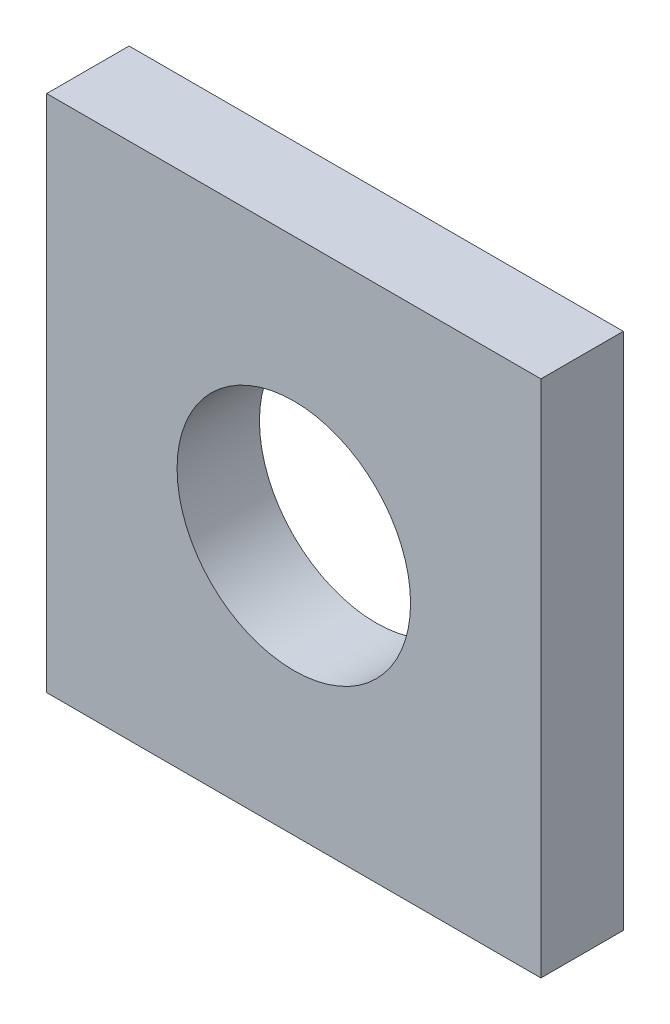
ISO-10303-21;
HEADER;
FILE_DESCRIPTION(('STEP AP214'),'2;1');
FILE_NAME('part.step','',(''),(''),'','','');
FILE_SCHEMA(('AUTOMOTIVE_DESIGN { 1 0 10303 214 1 1 1 1 }'));
ENDSEC;
DATA;
#1=APPLICATION_CONTEXT('core data for automotive mechanical design processes');
#2=APPLICATION_PROTOCOL_DEFINITION('international standard','automotive_design',2000,#1);
#3=PRODUCT_CONTEXT('',#1,'mechanical');
#4=PRODUCT('Part','Part','',(#3));
#5=PRODUCT_RELATED_PRODUCT_CATEGORY('part','',(#4));
#6=PRODUCT_DEFINITION_FORMATION('','',#4);
#7=PRODUCT_DEFINITION_CONTEXT('part definition',#1,'design');
#8=PRODUCT_DEFINITION('design','',#6,#7);
#9=PRODUCT_DEFINITION_SHAPE('','',#8);
#10=(LENGTH_UNIT() NAMED_UNIT(*) SI_UNIT(.MILLI.,.METRE.));
#11=(NAMED_UNIT(*) PLANE_ANGLE_UNIT() SI_UNIT($,.RADIAN.));
#12=(NAMED_UNIT(*) SI_UNIT($,.STERADIAN.) SOLID_ANGLE_UNIT());
#13=UNCERTAINTY_MEASURE_WITH_UNIT(LENGTH_MEASURE(1.E-05),#10,'distance_accuracy_value','');
#14=(GEOMETRIC_REPRESENTATION_CONTEXT(3) GLOBAL_UNCERTAINTY_ASSIGNED_CONTEXT((#13)) GLOBAL_UNIT_ASSIGNED_CONTEXT((#10,
#11,#12)) REPRESENTATION_CONTEXT('',''));
#15=CARTESIAN_POINT('',(0.,0.,0.));
#16=DIRECTION('',(0.,0.,1.));
#17=DIRECTION('',(1.,0.,0.));
#18=AXIS2_PLACEMENT_3D('',#15,#16,#17);
#19=CARTESIAN_POINT('',(-7.475,10.0000000000005,3.175));
#20=DIRECTION('',(0.,-1.,0.));
#21=DIRECTION('',(0.,0.,-1.));
#22=AXIS2_PLACEMENT_3D('',#19,#20,#21);
#23=PLANE('',#22);
#24=DIRECTION('',(-1.,0.,0.));
#25=VECTOR('',#24,1.);
#26=CARTESIAN_POINT('',(-7.475,10.0000000000005,0.));
#27=LINE('',#26,#25);
#28=CARTESIAN_POINT('',(-7.475,10.0000000000005,0.));
#29=VERTEX_POINT('',#28);
#30=CARTESIAN_POINT('',(-26.525,10.0000000000005,0.));
#31=VERTEX_POINT('',#30);
#32=EDGE_CURVE('E98',#29,#31,#27,.T.);
#33=ORIENTED_EDGE('',*,*,#32,.T.);
#34=DIRECTION('',(0.,0.,-1.));
#35=VECTOR('',#34,1.);
#36=CARTESIAN_POINT('',(-26.525,10.0000000000005,3.175));
#37=LINE('',#36,#35);
#38=CARTESIAN_POINT('',(-26.525,10.0000000000005,3.175));
#39=VERTEX_POINT('',#38);
#40=EDGE_CURVE('E11',#39,#31,#37,.T.);
#41=ORIENTED_EDGE('',*,*,#40,.F.);
#42=DIRECTION('',(-1.,0.,0.));
#43=VECTOR('',#42,1.);
#44=CARTESIAN_POINT('',(-7.475,10.0000000000005,3.175));
#45=LINE('',#44,#43);
#46=CARTESIAN_POINT('',(-7.475,10.0000000000005,3.175));
#47=VERTEX_POINT('',#46);
#48=EDGE_CURVE('E84',#47,#39,#45,.T.);
#49=ORIENTED_EDGE('',*,*,#48,.F.);
#50=DIRECTION('',(0.,0.,-1.));
#51=VECTOR('',#50,1.);
#52=CARTESIAN_POINT('',(-7.475,10.0000000000005,3.175));
#53=LINE('',#52,#51);
#54=EDGE_CURVE('E51',#47,#29,#53,.T.);
#55=ORIENTED_EDGE('',*,*,#54,.T.);
#56=EDGE_LOOP('',(#33,#41,#49,#55));
#57=FACE_BOUND('',#56,.T.);
#58=ADVANCED_FACE('F35',(#57),#23,.F.);
#59=CARTESIAN_POINT('',(-26.525,10.0000000000005,3.175));
#60=DIRECTION('',(1.,0.,0.));
#61=DIRECTION('',(0.,1.,0.));
#62=AXIS2_PLACEMENT_3D('',#59,#60,#61);
#63=PLANE('',#62);
#64=DIRECTION('',(0.,-1.,0.));
#65=VECTOR('',#64,1.);
#66=CARTESIAN_POINT('',(-26.525,10.0000000000005,0.));
#67=LINE('',#66,#65);
#68=CARTESIAN_POINT('',(-26.525,-10.0000000000004,0.));
#69=VERTEX_POINT('',#68);
#70=EDGE_CURVE('E89',#31,#69,#67,.T.);
#71=ORIENTED_EDGE('',*,*,#70,.T.);
#72=DIRECTION('',(0.,0.,-1.));
#73=VECTOR('',#72,1.);
#74=CARTESIAN_POINT('',(-26.525,-10.0000000000004,3.175));
#75=LINE('',#74,#73);
#76=CARTESIAN_POINT('',(-26.525,-10.0000000000004,3.175));
#77=VERTEX_POINT('',#76);
#78=EDGE_CURVE('E43',#77,#69,#75,.T.);
#79=ORIENTED_EDGE('',*,*,#78,.F.);
#80=DIRECTION('',(0.,-1.,0.));
#81=VECTOR('',#80,1.);
#82=CARTESIAN_POINT('',(-26.525,10.0000000000005,3.175));
#83=LINE('',#82,#81);
#84=EDGE_CURVE('E76',#39,#77,#83,.T.);
#85=ORIENTED_EDGE('',*,*,#84,.F.);
#86=ORIENTED_EDGE('',*,*,#40,.T.);
#87=EDGE_LOOP('',(#71,#79,#85,#86));
#88=FACE_BOUND('',#87,.T.);
#89=ADVANCED_FACE('F88',(#88),#63,.F.);
#90=CARTESIAN_POINT('',(-7.475,-10.0000000000004,3.175));
#91=DIRECTION('',(0.,-1.,0.));
#92=DIRECTION('',(0.,0.,-1.));
#93=AXIS2_PLACEMENT_3D('',#90,#91,#92);
#94=PLANE('',#93);
#95=DIRECTION('',(-1.,0.,0.));
#96=VECTOR('',#95,1.);
#97=CARTESIAN_POINT('',(-7.475,-10.0000000000004,0.));
#98=LINE('',#97,#96);
#99=CARTESIAN_POINT('',(-7.475,-10.0000000000004,0.));
#100=VERTEX_POINT('',#99);
#101=EDGE_CURVE('E102',#100,#69,#98,.T.);
#102=ORIENTED_EDGE('',*,*,#101,.F.);
#103=DIRECTION('',(0.,0.,-1.));
#104=VECTOR('',#103,1.);
#105=CARTESIAN_POINT('',(-7.475,-10.0000000000004,3.175));
#106=LINE('',#105,#104);
#107=CARTESIAN_POINT('',(-7.475,-10.0000000000004,3.175));
#108=VERTEX_POINT('',#107);
#109=EDGE_CURVE('E65',#108,#100,#106,.T.);
#110=ORIENTED_EDGE('',*,*,#109,.F.);
#111=DIRECTION('',(-1.,0.,0.));
#112=VECTOR('',#111,1.);
#113=CARTESIAN_POINT('',(-7.475,-10.0000000000004,3.175));
#114=LINE('',#113,#112);
#115=EDGE_CURVE('E83',#108,#77,#114,.T.);
#116=ORIENTED_EDGE('',*,*,#115,.T.);
#117=ORIENTED_EDGE('',*,*,#78,.T.);
#118=EDGE_LOOP('',(#102,#110,#116,#117));
#119=FACE_BOUND('',#118,.T.);
#120=ADVANCED_FACE('F92',(#119),#94,.T.);
#121=CARTESIAN_POINT('',(-7.475,10.0000000000005,3.175));
#122=DIRECTION('',(1.,0.,0.));
#123=DIRECTION('',(0.,1.,0.));
#124=AXIS2_PLACEMENT_3D('',#121,#122,#123);
#125=PLANE('',#124);
#126=DIRECTION('',(0.,-1.,0.));
#127=VECTOR('',#126,1.);
#128=CARTESIAN_POINT('',(-7.475,10.0000000000005,0.));
#129=LINE('',#128,#127);
#130=EDGE_CURVE('E104',#29,#100,#129,.T.);
#131=ORIENTED_EDGE('',*,*,#130,.F.);
#132=ORIENTED_EDGE('',*,*,#54,.F.);
#133=DIRECTION('',(0.,-1.,0.));
#134=VECTOR('',#133,1.);
#135=CARTESIAN_POINT('',(-7.475,10.0000000000005,3.175));
#136=LINE('',#135,#134);
#137=EDGE_CURVE('E93',#47,#108,#136,.T.);
#138=ORIENTED_EDGE('',*,*,#137,.T.);
#139=ORIENTED_EDGE('',*,*,#109,.T.);
#140=EDGE_LOOP('',(#131,#132,#138,#139));
#141=FACE_BOUND('',#140,.T.);
#142=ADVANCED_FACE('F120',(#141),#125,.T.);
#143=CARTESIAN_POINT('',(0.,0.,3.175));
#144=DIRECTION('',(0.,0.,1.));
#145=DIRECTION('',(1.,0.,0.));
#146=AXIS2_PLACEMENT_3D('',#143,#144,#145);
#147=PLANE('',#146);
#148=CARTESIAN_POINT('',(-17.,0.,3.175));
#149=DIRECTION('',(0.,0.,1.));
#150=DIRECTION('',(1.,0.,0.));
#151=AXIS2_PLACEMENT_3D('',#148,#149,#150);
#152=CIRCLE('',#151,4.5);
#153=CARTESIAN_POINT('',(-12.5,0.,3.175));
#154=VERTEX_POINT('',#153);
#155=EDGE_CURVE('E112',#154,#154,#152,.T.);
#156=ORIENTED_EDGE('',*,*,#155,.F.);
#157=EDGE_LOOP('',(#156));
#158=FACE_BOUND('',#157,.T.);
#159=ORIENTED_EDGE('',*,*,#48,.T.);
#160=ORIENTED_EDGE('',*,*,#84,.T.);
#161=ORIENTED_EDGE('',*,*,#115,.F.);
#162=ORIENTED_EDGE('',*,*,#137,.F.);
#163=EDGE_LOOP('',(#159,#160,#161,#162));
#164=FACE_BOUND('',#163,.T.);
#165=ADVANCED_FACE('F80',(#158,#164),#147,.T.);
#166=CARTESIAN_POINT('',(0.,0.,0.));
#167=DIRECTION('',(0.,0.,1.));
#168=DIRECTION('',(1.,0.,0.));
#169=AXIS2_PLACEMENT_3D('',#166,#167,#168);
#170=PLANE('',#169);
#171=CARTESIAN_POINT('',(-17.,0.,0.));
#172=DIRECTION('',(0.,0.,1.));
#173=DIRECTION('',(1.,0.,0.));
#174=AXIS2_PLACEMENT_3D('',#171,#172,#173);
#175=CIRCLE('',#174,4.5);
#176=CARTESIAN_POINT('',(-12.5,0.,0.));
#177=VERTEX_POINT('',#176);
#178=EDGE_CURVE('E100',#177,#177,#175,.T.);
#179=ORIENTED_EDGE('',*,*,#178,.T.);
#180=EDGE_LOOP('',(#179));
#181=FACE_BOUND('',#180,.T.);
#182=ORIENTED_EDGE('',*,*,#32,.F.);
#183=ORIENTED_EDGE('',*,*,#130,.T.);
#184=ORIENTED_EDGE('',*,*,#101,.T.);
#185=ORIENTED_EDGE('',*,*,#70,.F.);
#186=EDGE_LOOP('',(#182,#183,#184,#185));
#187=FACE_BOUND('',#186,.T.);
#188=ADVANCED_FACE('F119',(#181,#187),#170,.F.);
#189=CARTESIAN_POINT('',(-17.,0.,3.175));
#190=DIRECTION('',(0.,0.,1.));
#191=DIRECTION('',(1.,0.,0.));
#192=AXIS2_PLACEMENT_3D('',#189,#190,#191);
#193=CYLINDRICAL_SURFACE('',#192,4.5);
#194=ORIENTED_EDGE('',*,*,#178,.F.);
#195=EDGE_LOOP('',(#194));
#196=FACE_BOUND('',#195,.T.);
#197=ORIENTED_EDGE('',*,*,#155,.T.);
#198=EDGE_LOOP('',(#197));
#199=FACE_BOUND('',#198,.T.);
#200=ADVANCED_FACE('F116',(#196,#199),#193,.F.);
#201=CLOSED_SHELL('',(#58,#89,#120,#142,#165,#188,#200));
#202=MANIFOLD_SOLID_BREP('B2',#201);
#203=ADVANCED_BREP_SHAPE_REPRESENTATION('',(#18,#202),#14);
#204=SHAPE_DEFINITION_REPRESENTATION(#9,#203);
ENDSEC;
END-ISO-10303-21;
